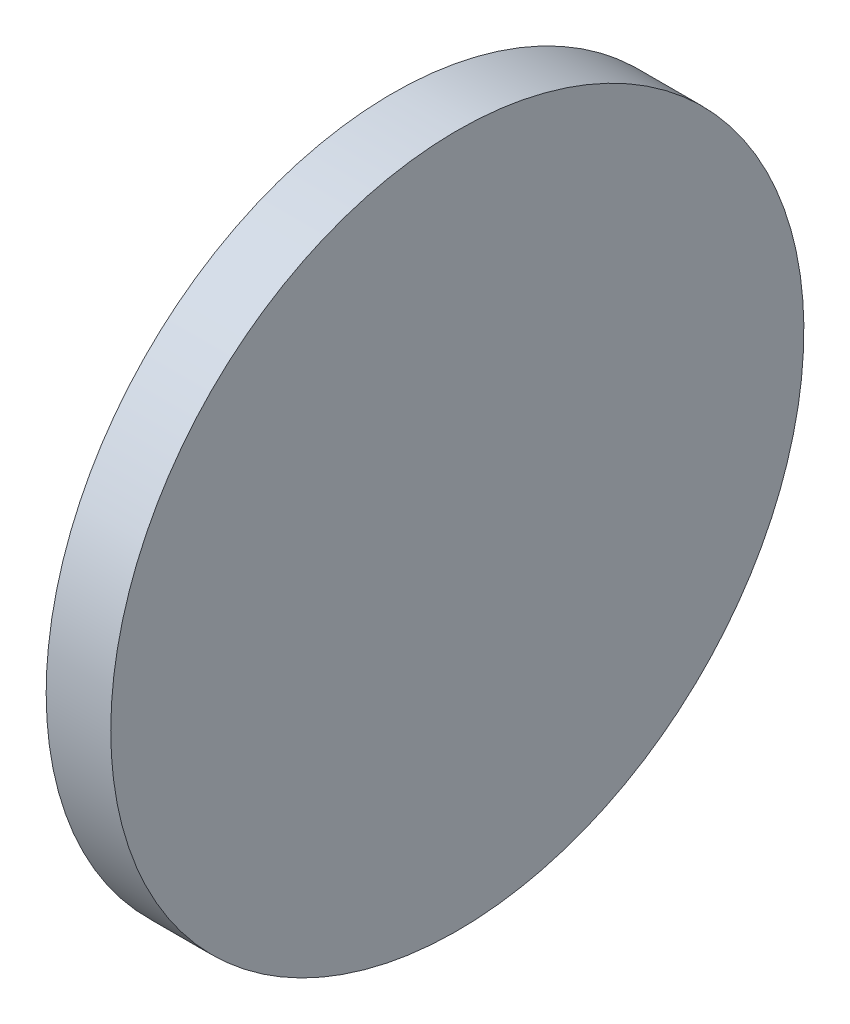
ISO-10303-21;
HEADER;
FILE_DESCRIPTION(('STEP AP214'),'2;1');
FILE_NAME('part.step','',(''),(''),'','','');
FILE_SCHEMA(('AUTOMOTIVE_DESIGN { 1 0 10303 214 1 1 1 1 }'));
ENDSEC;
DATA;
#1=APPLICATION_CONTEXT('core data for automotive mechanical design processes');
#2=APPLICATION_PROTOCOL_DEFINITION('international standard','automotive_design',2000,#1);
#3=PRODUCT_CONTEXT('',#1,'mechanical');
#4=PRODUCT('Part','Part','',(#3));
#5=PRODUCT_RELATED_PRODUCT_CATEGORY('part','',(#4));
#6=PRODUCT_DEFINITION_FORMATION('','',#4);
#7=PRODUCT_DEFINITION_CONTEXT('part definition',#1,'design');
#8=PRODUCT_DEFINITION('design','',#6,#7);
#9=PRODUCT_DEFINITION_SHAPE('','',#8);
#10=(LENGTH_UNIT() NAMED_UNIT(*) SI_UNIT(.MILLI.,.METRE.));
#11=(NAMED_UNIT(*) PLANE_ANGLE_UNIT() SI_UNIT($,.RADIAN.));
#12=(NAMED_UNIT(*) SI_UNIT($,.STERADIAN.) SOLID_ANGLE_UNIT());
#13=UNCERTAINTY_MEASURE_WITH_UNIT(LENGTH_MEASURE(1.E-05),#10,'distance_accuracy_value','');
#14=(GEOMETRIC_REPRESENTATION_CONTEXT(3) GLOBAL_UNCERTAINTY_ASSIGNED_CONTEXT((#13)) GLOBAL_UNIT_ASSIGNED_CONTEXT((#10,
#11,#12)) REPRESENTATION_CONTEXT('',''));
#15=CARTESIAN_POINT('',(0.,0.,0.));
#16=DIRECTION('',(0.,0.,1.));
#17=DIRECTION('',(1.,0.,0.));
#18=AXIS2_PLACEMENT_3D('',#15,#16,#17);
#19=CARTESIAN_POINT('',(-72.6014579242858,-1.44315441883233,-24.8428814120768));
#20=CARTESIAN_POINT('',(-72.6014579242858,-1.77786024486609,-24.8428814120768));
#21=CARTESIAN_POINT('',(-72.6014579242859,-2.44727189693362,-24.9088127051125));
#22=CARTESIAN_POINT('',(-72.6014579242859,-3.41280170346705,-25.2017029698485));
#23=CARTESIAN_POINT('',(-72.6014579242859,-4.30263906944289,-25.6773309511477));
#24=CARTESIAN_POINT('',(-72.6014579242858,-5.08258804391324,-26.317418532424));
#25=CARTESIAN_POINT('',(-72.6014579242859,-5.72267562518961,-27.0973675068944));
#26=CARTESIAN_POINT('',(-72.6014579242859,-6.19830360648881,-27.9872048728702));
#27=CARTESIAN_POINT('',(-72.6014579242859,-6.49119387122477,-28.9527346794037));
#28=CARTESIAN_POINT('',(-72.6014579242858,-6.59009081077842,-29.956852157505));
#29=CARTESIAN_POINT('',(-72.6014579242859,-6.49119387122477,-30.9609696356063));
#30=CARTESIAN_POINT('',(-72.6014579242859,-6.19830360648881,-31.9264994421397));
#31=CARTESIAN_POINT('',(-72.6014579242859,-5.72267562518961,-32.8163368081155));
#32=CARTESIAN_POINT('',(-72.6014579242859,-5.08258804391323,-33.5962857825859));
#33=CARTESIAN_POINT('',(-72.6014579242858,-4.30263906944289,-34.2363733638623));
#34=CARTESIAN_POINT('',(-72.6014579242859,-3.41280170346705,-34.7120013451615));
#35=CARTESIAN_POINT('',(-72.6014579242858,-2.44727189693362,-35.0048916098974));
#36=CARTESIAN_POINT('',(-72.6014579242859,-1.44315441883233,-35.1037885494511));
#37=CARTESIAN_POINT('',(-72.6014579242859,-0.439036940731032,-35.0048916098974));
#38=CARTESIAN_POINT('',(-72.6014579242858,0.526492865802393,-34.7120013451614));
#39=CARTESIAN_POINT('',(-72.6014579242859,1.41633023177824,-34.2363733638622));
#40=CARTESIAN_POINT('',(-72.6014579242859,2.19627920624858,-33.5962857825859));
#41=CARTESIAN_POINT('',(-72.6014579242859,2.83636678752495,-32.8163368081155));
#42=CARTESIAN_POINT('',(-72.6014579242858,3.31199476882416,-31.9264994421397));
#43=CARTESIAN_POINT('',(-72.6014579242859,3.60488503356012,-30.9609696356063));
#44=CARTESIAN_POINT('',(-72.6014579242859,3.70378197311377,-29.956852157505));
#45=CARTESIAN_POINT('',(-72.6014579242859,3.60488503356012,-28.9527346794037));
#46=CARTESIAN_POINT('',(-72.6014579242859,3.31199476882416,-27.9872048728702));
#47=CARTESIAN_POINT('',(-72.6014579242859,2.83636678752495,-27.0973675068944));
#48=CARTESIAN_POINT('',(-72.6014579242859,2.19627920624858,-26.3174185324241));
#49=CARTESIAN_POINT('',(-72.6014579242859,1.41633023177824,-25.6773309511477));
#50=CARTESIAN_POINT('',(-72.6014579242859,0.526492865802399,-25.2017029698485));
#51=CARTESIAN_POINT('',(-72.6014579242859,-0.439036940731031,-24.9088127051125));
#52=CARTESIAN_POINT('',(-72.6014579242858,-1.10844859279856,-24.8428814120768));
#53=CARTESIAN_POINT('',(-72.6014579242858,-1.44315441883233,-24.8428814120768));
#54=B_SPLINE_CURVE_WITH_KNOTS('',3,(#19,#20,#21,#22,#23,#24,#25,#26,#27,#28,#29,#30,#31,#32,#33,
#34,#35,#36,#37,#38,#39,#40,#41,#42,#43,#44,#45,#46,#47,#48,#49,#50,#51,#52,#53),.UNSPECIFIED.,
.T.,.F.,(4,1,1,1,1,1,1,1,1,1,1,1,1,1,1,1,1,1,1,1,1,1,1,1,1,1,1,1,1,1,1,1,4),(0.,0.03125,0.0625,
0.09375,0.125,0.15625,0.1875,0.21875,0.25,0.28125,0.3125,0.34375,0.375,0.40625,0.4375,0.46875,
0.5,0.53125,0.5625,0.59375,0.625,0.65625,0.6875,0.71875,0.75,0.78125,0.8125,0.84375,0.875,
0.90625,0.9375,0.96875,1.),.UNSPECIFIED.);
#55=DIRECTION('',(-1.,0.,0.));
#56=VECTOR('',#55,1.);
#57=SURFACE_OF_LINEAR_EXTRUSION('',#54,#56);
#58=CARTESIAN_POINT('',(-72.6014579242859,-1.44315441883233,-24.8428814120768));
#59=CARTESIAN_POINT('',(-72.6014579242859,-1.35947744852017,-24.8428814294332));
#60=CARTESIAN_POINT('',(-72.6014579242859,-1.27580108719835,-24.8449417895898));
#61=CARTESIAN_POINT('',(-72.6014579242859,-1.10864933966623,-24.8531633893883));
#62=CARTESIAN_POINT('',(-72.6014579242859,-1.02517395502213,-24.8593246608851));
#63=CARTESIAN_POINT('',(-72.6014579242859,-0.858625224189889,-24.8757282766317));
#64=CARTESIAN_POINT('',(-72.6014579242859,-0.775551878001752,-24.8859706208816));
#65=CARTESIAN_POINT('',(-72.6014579242859,-0.610007776786704,-24.9105167120388));
#66=CARTESIAN_POINT('',(-72.6014579242859,-0.527537017083982,-24.9248204273972));
#67=CARTESIAN_POINT('',(-72.6014579242859,-0.36339942156737,-24.9574694245553));
#68=CARTESIAN_POINT('',(-72.6014579242859,-0.28173258575348,-24.975814706355));
#69=CARTESIAN_POINT('',(-72.6014579242859,-0.119396384715076,-25.0164880645046));
#70=CARTESIAN_POINT('',(-72.6014579242859,-0.0387270272437294,-25.0388161717913));
#71=CARTESIAN_POINT('',(-72.6014579242859,0.121421280976538,-25.0873966299091));
#72=CARTESIAN_POINT('',(-72.6014579242859,0.200900231725458,-25.1136489807403));
#73=CARTESIAN_POINT('',(-72.6014579242859,0.35847475769488,-25.1700194809434));
#74=CARTESIAN_POINT('',(-72.6014579242859,0.436570343656408,-25.2001376002848));
#75=CARTESIAN_POINT('',(-72.6014579242859,0.591184574429195,-25.2641809115999));
#76=CARTESIAN_POINT('',(-72.6014579242859,0.667703219240453,-25.2981061035737));
#77=CARTESIAN_POINT('',(-72.6014579242859,0.818985198094877,-25.3696681565231));
#78=CARTESIAN_POINT('',(-72.6014579242859,0.893748518498367,-25.4073050463285));
#79=CARTESIAN_POINT('',(-72.6014579242859,1.04134204441298,-25.4861954295235));
#80=CARTESIAN_POINT('',(-72.6014579242859,1.1141722499241,-25.527448922913));
#81=CARTESIAN_POINT('',(-72.6014579242859,1.25772168659196,-25.613477544791));
#82=CARTESIAN_POINT('',(-72.6014579242859,1.328440934142,-25.6582526459215));
#83=CARTESIAN_POINT('',(-72.6014579242859,1.46759006557931,-25.7512291230329));
#84=CARTESIAN_POINT('',(-72.6014579242859,1.53601994946659,-25.7994304990137));
#85=CARTESIAN_POINT('',(-72.6014579242859,1.67043402356808,-25.8991311571531));
#86=CARTESIAN_POINT('',(-72.6014579242859,1.7364181947803,-25.9506304649265));
#87=CARTESIAN_POINT('',(-72.6014579242859,1.86578500221738,-26.0567990600274));
#88=CARTESIAN_POINT('',(-72.6014579242859,1.92916763844226,-26.1114683473548));
#89=CARTESIAN_POINT('',(-72.6014579242859,2.05317546139184,-26.2238490592109));
#90=CARTESIAN_POINT('',(-72.6014579242859,2.11380066953212,-26.2815604601056));
#91=CARTESIAN_POINT('',(-72.6014579242859,2.23213727856706,-26.3998970691405));
#92=CARTESIAN_POINT('',(-72.6014579242859,2.28984867946172,-26.4605222772808));
#93=CARTESIAN_POINT('',(-72.6014579242859,2.40222939131788,-26.5845301002304));
#94=CARTESIAN_POINT('',(-72.6014579242859,2.45689867864529,-26.6479127364553));
#95=CARTESIAN_POINT('',(-72.6014579242859,2.56306727374612,-26.7772795438923));
#96=CARTESIAN_POINT('',(-72.6014579242859,2.61456658151954,-26.8432637151046));
#97=CARTESIAN_POINT('',(-72.6014579242859,2.71426723965892,-26.9776777892061));
#98=CARTESIAN_POINT('',(-72.6014579242859,2.76246861563974,-27.0461076730934));
#99=CARTESIAN_POINT('',(-72.6014579242859,2.85544509275112,-27.1852568045306));
#100=CARTESIAN_POINT('',(-72.6014579242859,2.90022019388167,-27.2559760520805));
#101=CARTESIAN_POINT('',(-72.6014579242859,2.98624881575968,-27.3995254887487));
#102=CARTESIAN_POINT('',(-72.6014579242859,3.02750230914919,-27.4723556942603));
#103=CARTESIAN_POINT('',(-72.6014579242859,3.10639269234408,-27.6199492201736));
#104=CARTESIAN_POINT('',(-72.6014579242859,3.14402958214944,-27.6947125405753));
#105=CARTESIAN_POINT('',(-72.6014579242859,3.2155916350991,-27.8459945194347));
#106=CARTESIAN_POINT('',(-72.6014579242859,3.24951682707317,-27.9225131642528));
#107=CARTESIAN_POINT('',(-72.6014579242859,3.3135601383874,-28.0771273950069));
#108=CARTESIAN_POINT('',(-72.6014579242859,3.34367825772756,-28.1552229809429));
#109=CARTESIAN_POINT('',(-72.6014579242859,3.40004875793405,-28.3127975069821));
#110=CARTESIAN_POINT('',(-72.6014579242859,3.42630110876994,-28.3922764578262));
#111=CARTESIAN_POINT('',(-72.6014579242859,3.47488156687494,-28.5524247657863));
#112=CARTESIAN_POINT('',(-72.6014579242859,3.49720967414405,-28.6330941229021));
#113=CARTESIAN_POINT('',(-72.6014579242859,3.53788303234158,-28.7954303249118));
#114=CARTESIAN_POINT('',(-72.6014579242859,3.55622831420681,-28.8770971620524));
#115=CARTESIAN_POINT('',(-72.6014579242859,3.58887731118599,-29.0412347539442));
#116=CARTESIAN_POINT('',(-72.6014579242859,3.60318102629996,-29.1237055086953));
#117=CARTESIAN_POINT('',(-72.6014579242859,3.62772711812493,-29.2892496234385));
#118=CARTESIAN_POINT('',(-72.6014579242859,3.63796946328706,-29.3723229881066));
#119=CARTESIAN_POINT('',(-72.6014579242859,3.65437307654143,-29.5388716684507));
#120=CARTESIAN_POINT('',(-72.6014579242859,3.66053434463367,-29.6223469841266));
#121=CARTESIAN_POINT('',(-72.6014579242859,3.66875595373344,-29.7894989200825));
#122=CARTESIAN_POINT('',(-72.6014579242859,3.67081632659588,-29.8731755387937));
#123=CARTESIAN_POINT('',(-72.6014579242859,3.67081632659588,-30.0405287762162));
#124=CARTESIAN_POINT('',(-72.6014579242859,3.66875595373344,-30.1242053949274));
#125=CARTESIAN_POINT('',(-72.6014579242859,3.66053434463367,-30.2913573308833));
#126=CARTESIAN_POINT('',(-72.6014579242859,3.65437307654143,-30.3748326465593));
#127=CARTESIAN_POINT('',(-72.6014579242859,3.63796946328706,-30.5413813269033));
#128=CARTESIAN_POINT('',(-72.6014579242859,3.62772711812493,-30.6244546915714));
#129=CARTESIAN_POINT('',(-72.6014579242859,3.60318102629996,-30.7899988063146));
#130=CARTESIAN_POINT('',(-72.6014579242859,3.58887731118599,-30.8724695610657));
#131=CARTESIAN_POINT('',(-72.6014579242859,3.5562283142068,-31.0366071529575));
#132=CARTESIAN_POINT('',(-72.6014579242859,3.53788303234158,-31.1182739900982));
#133=CARTESIAN_POINT('',(-72.6014579242859,3.49720967414404,-31.2806101921079));
#134=CARTESIAN_POINT('',(-72.6014579242859,3.47488156687494,-31.3612795492237));
#135=CARTESIAN_POINT('',(-72.6014579242859,3.42630110876994,-31.5214278571837));
#136=CARTESIAN_POINT('',(-72.6014579242859,3.40004875793405,-31.6009068080279));
#137=CARTESIAN_POINT('',(-72.6014579242859,3.34367825772756,-31.758481334067));
#138=CARTESIAN_POINT('',(-72.6014579242859,3.3135601383874,-31.836576920003));
#139=CARTESIAN_POINT('',(-72.6014579242859,3.24951682707317,-31.9911911507571));
#140=CARTESIAN_POINT('',(-72.6014579242859,3.21559163509909,-32.0677097955752));
#141=CARTESIAN_POINT('',(-72.6014579242859,3.14402958214944,-32.2189917744347));
#142=CARTESIAN_POINT('',(-72.6014579242859,3.10639269234407,-32.2937550948363));
#143=CARTESIAN_POINT('',(-72.6014579242859,3.02750230914919,-32.4413486207496));
#144=CARTESIAN_POINT('',(-72.6014579242859,2.98624881575967,-32.5141788262612));
#145=CARTESIAN_POINT('',(-72.6014579242859,2.90022019388166,-32.6577282629294));
#146=CARTESIAN_POINT('',(-72.6014579242859,2.85544509275111,-32.7284475104793));
#147=CARTESIAN_POINT('',(-72.6014579242859,2.76246861563974,-32.8675966419166));
#148=CARTESIAN_POINT('',(-72.6014579242859,2.71426723965891,-32.9360265258039));
#149=CARTESIAN_POINT('',(-72.6014579242859,2.61456658151953,-33.0704405999054));
#150=CARTESIAN_POINT('',(-72.6014579242859,2.56306727374611,-33.1364247711176));
#151=CARTESIAN_POINT('',(-72.6014579242859,2.45689867864528,-33.2657915785547));
#152=CARTESIAN_POINT('',(-72.6014579242859,2.40222939131787,-33.3291742147795));
#153=CARTESIAN_POINT('',(-72.6014579242859,2.28984867946171,-33.4531820377291));
#154=CARTESIAN_POINT('',(-72.6014579242859,2.23213727856705,-33.5138072458694));
#155=CARTESIAN_POINT('',(-72.6014579242859,2.11380066953211,-33.6321438549043));
#156=CARTESIAN_POINT('',(-72.6014579242859,2.05317546139184,-33.689855255799));
#157=CARTESIAN_POINT('',(-72.6014579242859,1.92916763844225,-33.8022359676552));
#158=CARTESIAN_POINT('',(-72.6014579242859,1.86578500221737,-33.8569052549826));
#159=CARTESIAN_POINT('',(-72.6014579242859,1.73641819478029,-33.9630738500834));
#160=CARTESIAN_POINT('',(-72.6014579242859,1.67043402356809,-34.0145731578568));
#161=CARTESIAN_POINT('',(-72.6014579242859,1.53601994946657,-34.1142738159962));
#162=CARTESIAN_POINT('',(-72.6014579242859,1.46759006557926,-34.162475191977));
#163=CARTESIAN_POINT('',(-72.6014579242859,1.32844093414204,-34.2554516690884));
#164=CARTESIAN_POINT('',(-72.6014579242859,1.25772168659213,-34.300226770219));
#165=CARTESIAN_POINT('',(-72.6014579242859,1.11417224992391,-34.386255392097));
#166=CARTESIAN_POINT('',(-72.6014579242859,1.0413420444123,-34.4275088854865));
#167=CARTESIAN_POINT('',(-72.6014579242859,0.893748518499027,-34.5063992686814));
#168=CARTESIAN_POINT('',(-72.6014579242859,0.818985198097371,-34.5440361584867));
#169=CARTESIAN_POINT('',(-72.6014579242859,0.667703219237941,-34.6155982114364));
#170=CARTESIAN_POINT('',(-72.6014579242859,0.591184574419841,-34.6495234034105));
#171=CARTESIAN_POINT('',(-72.6014579242859,0.43657034366574,-34.7135667147247));
#172=CARTESIAN_POINT('',(-72.6014579242859,0.358474757729737,-34.7436848340649));
#173=CARTESIAN_POINT('',(-72.6014579242859,0.200900231690581,-34.8000553342713));
#174=CARTESIAN_POINT('',(-72.6014579242859,0.121421280846399,-34.8263076851072));
#175=CARTESIAN_POINT('',(-72.6014579242859,-0.0387270271136126,-34.8748881432122));
#176=CARTESIAN_POINT('',(-72.6014579242859,-0.119396384229442,-34.8972162504813));
#177=CARTESIAN_POINT('',(-72.6014579242859,-0.281732586239127,-34.9378896086789));
#178=CARTESIAN_POINT('',(-72.6014579242859,-0.363399423379803,-34.9562348905441));
#179=CARTESIAN_POINT('',(-72.6014579242859,-0.527537015271567,-34.9888838875233));
#180=CARTESIAN_POINT('',(-72.6014579242859,-0.610007770022656,-35.0031876026373));
#181=CARTESIAN_POINT('',(-72.6014579242859,-0.77555188476587,-35.0277336944622));
#182=CARTESIAN_POINT('',(-72.6014579242859,-0.858625249433989,-35.0379760396244));
#183=CARTESIAN_POINT('',(-72.6014579242859,-1.02517392977805,-35.0543796528787));
#184=CARTESIAN_POINT('',(-72.6014579242859,-1.10864924545399,-35.060540920971));
#185=CARTESIAN_POINT('',(-72.6014579242859,-1.27580118140989,-35.0687625300707));
#186=CARTESIAN_POINT('',(-72.6014579242859,-1.35947780012111,-35.0708229029332));
#187=CARTESIAN_POINT('',(-72.6014579242859,-1.52683103754356,-35.0708229029332));
#188=CARTESIAN_POINT('',(-72.6014579242859,-1.61050765625478,-35.0687625300707));
#189=CARTESIAN_POINT('',(-72.6014579242859,-1.77765959221068,-35.060540920971));
#190=CARTESIAN_POINT('',(-72.6014579242859,-1.86113490788662,-35.0543796528787));
#191=CARTESIAN_POINT('',(-72.6014579242859,-2.02768358823068,-35.0379760396243));
#192=CARTESIAN_POINT('',(-72.6014579242859,-2.1107569528988,-35.0277336944622));
#193=CARTESIAN_POINT('',(-72.6014579242859,-2.27630106764201,-35.0031876026372));
#194=CARTESIAN_POINT('',(-72.6014579242859,-2.3587718223931,-34.9888838875233));
#195=CARTESIAN_POINT('',(-72.6014579242859,-2.52290941428486,-34.9562348905441));
#196=CARTESIAN_POINT('',(-72.6014579242859,-2.60457625142554,-34.9378896086789));
#197=CARTESIAN_POINT('',(-72.6014579242859,-2.76691245343522,-34.8972162504813));
#198=CARTESIAN_POINT('',(-72.6014579242859,-2.84758181055105,-34.8748881432122));
#199=CARTESIAN_POINT('',(-72.6014579242859,-3.00773011851107,-34.8263076851072));
#200=CARTESIAN_POINT('',(-72.6014579242859,-3.08720906935525,-34.8000553342713));
#201=CARTESIAN_POINT('',(-72.6014579242859,-3.2447835953944,-34.7436848340649));
#202=CARTESIAN_POINT('',(-72.6014579242859,-3.32287918133041,-34.7135667147247));
#203=CARTESIAN_POINT('',(-72.6014579242859,-3.47749341208451,-34.6495234034105));
#204=CARTESIAN_POINT('',(-72.6014579242859,-3.5540120569026,-34.6155982114364));
#205=CARTESIAN_POINT('',(-72.6014579242859,-3.70529403576204,-34.5440361584867));
#206=CARTESIAN_POINT('',(-72.6014579242859,-3.7800573561637,-34.5063992686814));
#207=CARTESIAN_POINT('',(-72.6014579242859,-3.92765088207696,-34.4275088854865));
#208=CARTESIAN_POINT('',(-72.6014579242859,-4.00048108758857,-34.386255392097));
#209=CARTESIAN_POINT('',(-72.6014579242859,-4.1440305242568,-34.300226770219));
#210=CARTESIAN_POINT('',(-72.6014579242859,-4.21474977180671,-34.2554516690884));
#211=CARTESIAN_POINT('',(-72.6014579242859,-4.35389890324392,-34.162475191977));
#212=CARTESIAN_POINT('',(-72.6014579242859,-4.42232878713124,-34.1142738159962));
#213=CARTESIAN_POINT('',(-72.6014579242859,-4.55674286123275,-34.0145731578568));
#214=CARTESIAN_POINT('',(-72.6014579242859,-4.62272703244496,-33.9630738500834));
#215=CARTESIAN_POINT('',(-72.6014579242859,-4.75209383988203,-33.8569052549826));
#216=CARTESIAN_POINT('',(-72.6014579242859,-4.81547647610691,-33.8022359676552));
#217=CARTESIAN_POINT('',(-72.6014579242859,-4.9394842990565,-33.689855255799));
#218=CARTESIAN_POINT('',(-72.6014579242859,-5.00010950719678,-33.6321438549043));
#219=CARTESIAN_POINT('',(-72.6014579242859,-5.11844611623171,-33.5138072458694));
#220=CARTESIAN_POINT('',(-72.6014579242859,-5.17615751712637,-33.4531820377291));
#221=CARTESIAN_POINT('',(-72.6014579242859,-5.28853822898253,-33.3291742147795));
#222=CARTESIAN_POINT('',(-72.6014579242859,-5.34320751630994,-33.2657915785547));
#223=CARTESIAN_POINT('',(-72.6014579242859,-5.44937611141077,-33.1364247711176));
#224=CARTESIAN_POINT('',(-72.6014579242859,-5.50087541918419,-33.0704405999054));
#225=CARTESIAN_POINT('',(-72.6014579242859,-5.60057607732357,-32.9360265258039));
#226=CARTESIAN_POINT('',(-72.6014579242859,-5.6487774533044,-32.8675966419166));
#227=CARTESIAN_POINT('',(-72.6014579242859,-5.74175393041577,-32.7284475104793));
#228=CARTESIAN_POINT('',(-72.6014579242859,-5.78652903154632,-32.6577282629294));
#229=CARTESIAN_POINT('',(-72.6014579242859,-5.87255765342433,-32.5141788262612));
#230=CARTESIAN_POINT('',(-72.6014579242859,-5.91381114681385,-32.4413486207496));
#231=CARTESIAN_POINT('',(-72.6014579242859,-5.99270153000873,-32.2937550948363));
#232=CARTESIAN_POINT('',(-72.6014579242859,-6.0303384198141,-32.2189917744347));
#233=CARTESIAN_POINT('',(-72.6014579242859,-6.10190047276375,-32.0677097955752));
#234=CARTESIAN_POINT('',(-72.6014579242859,-6.13582566473782,-31.9911911507571));
#235=CARTESIAN_POINT('',(-72.6014579242859,-6.19986897605206,-31.836576920003));
#236=CARTESIAN_POINT('',(-72.6014579242859,-6.22998709539222,-31.758481334067));
#237=CARTESIAN_POINT('',(-72.6014579242859,-6.28635759559871,-31.6009068080279));
#238=CARTESIAN_POINT('',(-72.6014579242859,-6.31260994643459,-31.5214278571837));
#239=CARTESIAN_POINT('',(-72.6014579242859,-6.36119040453959,-31.3612795492237));
#240=CARTESIAN_POINT('',(-72.6014579242859,-6.3835185118087,-31.2806101921079));
#241=CARTESIAN_POINT('',(-72.6014579242859,-6.42419187000624,-31.1182739900982));
#242=CARTESIAN_POINT('',(-72.6014579242859,-6.44253715187146,-31.0366071529575));
#243=CARTESIAN_POINT('',(-72.6014579242859,-6.47518614885065,-30.8724695610657));
#244=CARTESIAN_POINT('',(-72.6014579242859,-6.48948986396461,-30.7899988063146));
#245=CARTESIAN_POINT('',(-72.6014579242859,-6.51403595578959,-30.6244546915714));
#246=CARTESIAN_POINT('',(-72.6014579242859,-6.52427830095171,-30.5413813269033));
#247=CARTESIAN_POINT('',(-72.6014579242859,-6.54068191420608,-30.3748326465593));
#248=CARTESIAN_POINT('',(-72.6014579242859,-6.54684318229832,-30.2913573308833));
#249=CARTESIAN_POINT('',(-72.6014579242859,-6.55506479139809,-30.1242053949274));
#250=CARTESIAN_POINT('',(-72.6014579242859,-6.55712516426054,-30.0405287762162));
#251=CARTESIAN_POINT('',(-72.6014579242859,-6.55712516426054,-29.8731755387937));
#252=CARTESIAN_POINT('',(-72.6014579242859,-6.55506479139809,-29.7894989200825));
#253=CARTESIAN_POINT('',(-72.6014579242859,-6.54684318229832,-29.6223469841266));
#254=CARTESIAN_POINT('',(-72.6014579242859,-6.54068191420608,-29.5388716684507));
#255=CARTESIAN_POINT('',(-72.6014579242859,-6.52427830095171,-29.3723229881066));
#256=CARTESIAN_POINT('',(-72.6014579242859,-6.51403595578958,-29.2892496234385));
#257=CARTESIAN_POINT('',(-72.6014579242859,-6.48948986396461,-29.1237055086953));
#258=CARTESIAN_POINT('',(-72.6014579242859,-6.47518614885065,-29.0412347539442));
#259=CARTESIAN_POINT('',(-72.6014579242859,-6.44253715187146,-28.8770971620524));
#260=CARTESIAN_POINT('',(-72.6014579242859,-6.42419187000624,-28.7954303249118));
#261=CARTESIAN_POINT('',(-72.6014579242859,-6.3835185118087,-28.6330941229021));
#262=CARTESIAN_POINT('',(-72.6014579242859,-6.36119040453959,-28.5524247657862));
#263=CARTESIAN_POINT('',(-72.6014579242859,-6.31260994643459,-28.3922764578262));
#264=CARTESIAN_POINT('',(-72.6014579242859,-6.28635759559871,-28.3127975069821));
#265=CARTESIAN_POINT('',(-72.6014579242859,-6.22998709539222,-28.1552229809429));
#266=CARTESIAN_POINT('',(-72.6014579242859,-6.19986897605205,-28.0771273950069));
#267=CARTESIAN_POINT('',(-72.6014579242859,-6.13582566473782,-27.9225131642528));
#268=CARTESIAN_POINT('',(-72.6014579242859,-6.10190047276375,-27.8459945194347));
#269=CARTESIAN_POINT('',(-72.6014579242859,-6.03033841981409,-27.6947125405753));
#270=CARTESIAN_POINT('',(-72.6014579242859,-5.99270153000873,-27.6199492201736));
#271=CARTESIAN_POINT('',(-72.6014579242859,-5.91381114681384,-27.4723556942603));
#272=CARTESIAN_POINT('',(-72.6014579242859,-5.87255765342433,-27.3995254887487));
#273=CARTESIAN_POINT('',(-72.6014579242859,-5.78652903154632,-27.2559760520805));
#274=CARTESIAN_POINT('',(-72.6014579242859,-5.74175393041577,-27.1852568045306));
#275=CARTESIAN_POINT('',(-72.6014579242859,-5.64877745330439,-27.0461076730934));
#276=CARTESIAN_POINT('',(-72.6014579242859,-5.60057607732357,-26.9776777892061));
#277=CARTESIAN_POINT('',(-72.6014579242859,-5.50087541918419,-26.8432637151046));
#278=CARTESIAN_POINT('',(-72.6014579242859,-5.44937611141077,-26.7772795438923));
#279=CARTESIAN_POINT('',(-72.6014579242859,-5.34320751630994,-26.6479127364553));
#280=CARTESIAN_POINT('',(-72.6014579242859,-5.28853822898253,-26.5845301002304));
#281=CARTESIAN_POINT('',(-72.6014579242859,-5.17615751712637,-26.4605222772808));
#282=CARTESIAN_POINT('',(-72.6014579242859,-5.11844611623171,-26.3998970691405));
#283=CARTESIAN_POINT('',(-72.6014579242859,-5.00010950719677,-26.2815604601056));
#284=CARTESIAN_POINT('',(-72.6014579242859,-4.9394842990565,-26.2238490592109));
#285=CARTESIAN_POINT('',(-72.6014579242859,-4.81547647610691,-26.1114683473548));
#286=CARTESIAN_POINT('',(-72.6014579242859,-4.75209383988203,-26.0567990600274));
#287=CARTESIAN_POINT('',(-72.6014579242859,-4.62272703244495,-25.9506304649265));
#288=CARTESIAN_POINT('',(-72.6014579242859,-4.55674286123273,-25.8991311571531));
#289=CARTESIAN_POINT('',(-72.6014579242859,-4.42232878713124,-25.7994304990137));
#290=CARTESIAN_POINT('',(-72.6014579242859,-4.35389890324396,-25.7512291230329));
#291=CARTESIAN_POINT('',(-72.6014579242859,-4.21474977180665,-25.6582526459215));
#292=CARTESIAN_POINT('',(-72.6014579242859,-4.14403052425661,-25.613477544791));
#293=CARTESIAN_POINT('',(-72.6014579242859,-4.00048108758875,-25.527448922913));
#294=CARTESIAN_POINT('',(-72.6014579242859,-3.92765088207763,-25.4861954295235));
#295=CARTESIAN_POINT('',(-72.6014579242859,-3.78005735616302,-25.4073050463285));
#296=CARTESIAN_POINT('',(-72.6014579242859,-3.70529403575953,-25.3696681565231));
#297=CARTESIAN_POINT('',(-72.6014579242859,-3.5540120569051,-25.2981061035737));
#298=CARTESIAN_POINT('',(-72.6014579242859,-3.47749341209385,-25.2641809115999));
#299=CARTESIAN_POINT('',(-72.6014579242859,-3.32287918132106,-25.2001376002848));
#300=CARTESIAN_POINT('',(-72.6014579242859,-3.24478359535953,-25.1700194809434));
#301=CARTESIAN_POINT('',(-72.6014579242859,-3.08720906939011,-25.1136489807403));
#302=CARTESIAN_POINT('',(-72.6014579242859,-3.00773011864119,-25.0873966299091));
#303=CARTESIAN_POINT('',(-72.6014579242859,-2.84758181042092,-25.0388161717913));
#304=CARTESIAN_POINT('',(-72.6014579242859,-2.76691245294957,-25.0164880645046));
#305=CARTESIAN_POINT('',(-72.6014579242859,-2.60457625191117,-24.975814706355));
#306=CARTESIAN_POINT('',(-72.6014579242859,-2.52290941609728,-24.9574694245553));
#307=CARTESIAN_POINT('',(-72.6014579242859,-2.35877182058067,-24.9248204273972));
#308=CARTESIAN_POINT('',(-72.6014579242859,-2.27630106087795,-24.9105167120388));
#309=CARTESIAN_POINT('',(-72.6014579242859,-2.1107569596629,-24.8859706208816));
#310=CARTESIAN_POINT('',(-72.6014579242859,-2.02768361347476,-24.8757282766317));
#311=CARTESIAN_POINT('',(-72.6014579242859,-1.86113488264252,-24.8593246608851));
#312=CARTESIAN_POINT('',(-72.6014579242859,-1.77765949799842,-24.8531633893883));
#313=CARTESIAN_POINT('',(-72.6014579242859,-1.6105077504663,-24.8449417895898));
#314=CARTESIAN_POINT('',(-72.6014579242859,-1.52683138914448,-24.8428814294332));
#315=CARTESIAN_POINT('',(-72.6014579242859,-1.44315441883233,-24.8428814120768));
#316=B_SPLINE_CURVE_WITH_KNOTS('',3,(#58,#59,#60,#61,#62,#63,#64,#65,#66,#67,#68,#69,#70,#71,
#72,#73,#74,#75,#76,#77,#78,#79,#80,#81,#82,#83,#84,#85,#86,#87,#88,#89,#90,#91,#92,#93,#94,#95,
#96,#97,#98,#99,#100,#101,#102,#103,#104,#105,#106,#107,#108,#109,#110,#111,#112,#113,#114,#115,
#116,#117,#118,#119,#120,#121,#122,#123,#124,#125,#126,#127,#128,#129,#130,#131,#132,#133,#134,
#135,#136,#137,#138,#139,#140,#141,#142,#143,#144,#145,#146,#147,#148,#149,#150,#151,#152,#153,
#154,#155,#156,#157,#158,#159,#160,#161,#162,#163,#164,#165,#166,#167,#168,#169,#170,#171,#172,
#173,#174,#175,#176,#177,#178,#179,#180,#181,#182,#183,#184,#185,#186,#187,#188,#189,#190,#191,
#192,#193,#194,#195,#196,#197,#198,#199,#200,#201,#202,#203,#204,#205,#206,#207,#208,#209,#210,
#211,#212,#213,#214,#215,#216,#217,#218,#219,#220,#221,#222,#223,#224,#225,#226,#227,#228,#229,
#230,#231,#232,#233,#234,#235,#236,#237,#238,#239,#240,#241,#242,#243,#244,#245,#246,#247,#248,
#249,#250,#251,#252,#253,#254,#255,#256,#257,#258,#259,#260,#261,#262,#263,#264,#265,#266,#267,
#268,#269,#270,#271,#272,#273,#274,#275,#276,#277,#278,#279,#280,#281,#282,#283,#284,#285,#286,
#287,#288,#289,#290,#291,#292,#293,#294,#295,#296,#297,#298,#299,#300,#301,#302,#303,#304,#305,
#306,#307,#308,#309,#310,#311,#312,#313,#314,#315),.UNSPECIFIED.,.F.,.F.,(4,2,2,2,2,2,2,2,2,2,2,
2,2,2,2,2,2,2,2,2,2,2,2,2,2,2,2,2,2,2,2,2,2,2,2,2,2,2,2,2,2,2,2,2,2,2,2,2,2,2,2,2,2,2,2,2,2,2,2,
2,2,2,2,2,2,2,2,2,2,2,2,2,2,2,2,2,2,2,2,2,2,2,2,2,2,2,2,2,2,2,2,2,2,2,2,2,2,2,2,2,2,2,2,2,2,2,2,
2,2,2,2,2,2,2,2,2,2,2,2,2,2,2,2,2,2,2,2,2,4),(0.,0.251004753842975,0.502011457462747,
0.753018161082518,1.00402291492549,1.25502766876847,1.50603437238824,1.75704107600801,
2.00804582985098,2.25905058369396,2.51005728731373,2.7610639909335,3.01206874477647,
3.26307349861945,3.51408020223922,3.765086905859,4.01609165970197,4.26709641354494,
4.51810311716471,4.76910982078449,5.02011457462746,5.27111932847044,5.52212603209021,
5.77313273570998,6.02413748955295,6.27514224339593,6.5261489470157,6.77715565063547,
7.02816040447845,7.27916515832142,7.53017186194118,7.78117856556096,8.03218331940393,
8.2831880732469,8.53419477686668,8.78520148048645,9.03620623432942,9.2872109881724,
9.53821769179217,9.78922439541194,10.0402291492549,10.2912339030979,10.5422406067177,
10.7932473103374,11.0442520641804,11.2952568180234,11.5462635216432,11.7972702252629,
12.0482749791059,12.2992797329489,12.5502864365686,12.8012931401884,13.0522978940314,
13.3033026478744,13.5543093514941,13.8053160551139,14.0563208089569,14.3073255627999,
14.5583322664196,14.8093389700394,15.0603437238824,15.3113484777253,15.5623551813451,
15.8133618849649,16.0643666388079,16.3153713926508,16.5663780962706,16.8173847998904,
17.0683895537334,17.3193943075763,17.5704010111961,17.8214077148159,18.0724124686588,
18.3234172225018,18.5744239261216,18.8254306297414,19.0764353835843,19.3274401374273,
19.5784468410471,19.8294535446669,20.0804582985098,20.3314630523528,20.5824697559726,
20.8334764595923,21.0844812134353,21.3354859672783,21.5864926708981,21.8374993745178,
22.0885041283608,22.3395088822038,22.5905155858235,22.8415222894433,23.0925270432863,
23.3435317971293,23.594538500749,23.8455452043688,24.0965499582118,24.3475547120548,
24.5985614156745,24.8495681192943,25.1005728731373,25.3515776269802,25.6025843306,
25.8535910342198,26.1045957880628,26.3556005419058,26.6066072455255,26.8576139491453,
27.1086187029883,27.3596234568312,27.610630160451,27.8616368640708,28.1126416179138,
28.3636463717567,28.6146530753765,28.8656597789963,29.1166645328392,29.3676692866822,
29.618675990302,29.8696826939218,30.1206874477647,30.3716922016077,30.6226989052275,
30.8737056088473,31.1247103626902,31.3757151165332,31.626721820153,31.8777285237727,
32.1287332776157),.UNSPECIFIED.);
#317=CARTESIAN_POINT('',(-72.6014579242859,-1.44315441883233,-24.8428814120768));
#318=VERTEX_POINT('',#317);
#319=EDGE_CURVE('E9',#318,#318,#316,.F.);
#320=ORIENTED_EDGE('',*,*,#319,.F.);
#321=EDGE_LOOP('',(#320));
#322=FACE_BOUND('',#321,.T.);
#323=CARTESIAN_POINT('',(-73.5542140571372,-1.44315441883233,-24.8428814120768));
#324=CARTESIAN_POINT('',(-73.5542140571372,-1.77786024486609,-24.8428814120768));
#325=CARTESIAN_POINT('',(-73.5542140571372,-2.44727189693362,-24.9088127051125));
#326=CARTESIAN_POINT('',(-73.5542140571372,-3.41280170346705,-25.2017029698485));
#327=CARTESIAN_POINT('',(-73.5542140571372,-4.30263906944289,-25.6773309511477));
#328=CARTESIAN_POINT('',(-73.5542140571372,-5.08258804391324,-26.317418532424));
#329=CARTESIAN_POINT('',(-73.5542140571372,-5.72267562518961,-27.0973675068944));
#330=CARTESIAN_POINT('',(-73.5542140571372,-6.19830360648881,-27.9872048728702));
#331=CARTESIAN_POINT('',(-73.5542140571372,-6.49119387122477,-28.9527346794037));
#332=CARTESIAN_POINT('',(-73.5542140571372,-6.59009081077842,-29.956852157505));
#333=CARTESIAN_POINT('',(-73.5542140571372,-6.49119387122477,-30.9609696356063));
#334=CARTESIAN_POINT('',(-73.5542140571372,-6.19830360648881,-31.9264994421397));
#335=CARTESIAN_POINT('',(-73.5542140571372,-5.72267562518961,-32.8163368081155));
#336=CARTESIAN_POINT('',(-73.5542140571372,-5.08258804391323,-33.5962857825859));
#337=CARTESIAN_POINT('',(-73.5542140571372,-4.30263906944289,-34.2363733638623));
#338=CARTESIAN_POINT('',(-73.5542140571372,-3.41280170346705,-34.7120013451615));
#339=CARTESIAN_POINT('',(-73.5542140571372,-2.44727189693362,-35.0048916098974));
#340=CARTESIAN_POINT('',(-73.5542140571372,-1.44315441883233,-35.1037885494511));
#341=CARTESIAN_POINT('',(-73.5542140571372,-0.439036940731032,-35.0048916098974));
#342=CARTESIAN_POINT('',(-73.5542140571372,0.526492865802393,-34.7120013451614));
#343=CARTESIAN_POINT('',(-73.5542140571372,1.41633023177824,-34.2363733638622));
#344=CARTESIAN_POINT('',(-73.5542140571372,2.19627920624858,-33.5962857825859));
#345=CARTESIAN_POINT('',(-73.5542140571372,2.83636678752495,-32.8163368081155));
#346=CARTESIAN_POINT('',(-73.5542140571371,3.31199476882416,-31.9264994421397));
#347=CARTESIAN_POINT('',(-73.5542140571372,3.60488503356012,-30.9609696356063));
#348=CARTESIAN_POINT('',(-73.5542140571372,3.70378197311377,-29.956852157505));
#349=CARTESIAN_POINT('',(-73.5542140571372,3.60488503356012,-28.9527346794037));
#350=CARTESIAN_POINT('',(-73.5542140571372,3.31199476882416,-27.9872048728702));
#351=CARTESIAN_POINT('',(-73.5542140571372,2.83636678752495,-27.0973675068944));
#352=CARTESIAN_POINT('',(-73.5542140571372,2.19627920624858,-26.3174185324241));
#353=CARTESIAN_POINT('',(-73.5542140571372,1.41633023177824,-25.6773309511477));
#354=CARTESIAN_POINT('',(-73.5542140571372,0.526492865802399,-25.2017029698485));
#355=CARTESIAN_POINT('',(-73.5542140571372,-0.439036940731031,-24.9088127051125));
#356=CARTESIAN_POINT('',(-73.5542140571372,-1.10844859279856,-24.8428814120768));
#357=CARTESIAN_POINT('',(-73.5542140571372,-1.44315441883233,-24.8428814120768));
#358=B_SPLINE_CURVE_WITH_KNOTS('',3,(#323,#324,#325,#326,#327,#328,#329,#330,#331,#332,#333,
#334,#335,#336,#337,#338,#339,#340,#341,#342,#343,#344,#345,#346,#347,#348,#349,#350,#351,#352,
#353,#354,#355,#356,#357),.UNSPECIFIED.,.T.,.F.,(4,1,1,1,1,1,1,1,1,1,1,1,1,1,1,1,1,1,1,1,1,1,1,
1,1,1,1,1,1,1,1,1,4),(0.,0.03125,0.0625,0.09375,0.125,0.15625,0.1875,0.21875,0.25,0.28125,
0.3125,0.34375,0.375,0.40625,0.4375,0.46875,0.5,0.53125,0.5625,0.59375,0.625,0.65625,0.6875,
0.71875,0.75,0.78125,0.8125,0.84375,0.875,0.90625,0.9375,0.96875,1.),.UNSPECIFIED.);
#359=CARTESIAN_POINT('',(-73.5542140571372,-1.44315441883233,-24.8428814120768));
#360=VERTEX_POINT('',#359);
#361=EDGE_CURVE('E24',#360,#360,#358,.T.);
#362=ORIENTED_EDGE('',*,*,#361,.T.);
#363=EDGE_LOOP('',(#362));
#364=FACE_BOUND('',#363,.T.);
#365=ADVANCED_FACE('F14',(#322,#364),#57,.F.);
#366=CARTESIAN_POINT('',(-72.6014579242859,-1.44315441883233,-34.9301566107805));
#367=DIRECTION('',(-1.,0.,0.));
#368=DIRECTION('',(0.,-1.,0.));
#369=AXIS2_PLACEMENT_3D('',#366,#367,#368);
#370=PLANE('',#369);
#371=ORIENTED_EDGE('',*,*,#319,.T.);
#372=EDGE_LOOP('',(#371));
#373=FACE_BOUND('',#372,.T.);
#374=ADVANCED_FACE('F59',(#373),#370,.F.);
#375=CARTESIAN_POINT('',(-73.5542140571372,-1.44315441883233,-34.9301566107805));
#376=DIRECTION('',(-1.,0.,0.));
#377=DIRECTION('',(0.,-1.,0.));
#378=AXIS2_PLACEMENT_3D('',#375,#376,#377);
#379=PLANE('',#378);
#380=ORIENTED_EDGE('',*,*,#361,.F.);
#381=EDGE_LOOP('',(#380));
#382=FACE_BOUND('',#381,.T.);
#383=ADVANCED_FACE('F67',(#382),#379,.T.);
#384=CLOSED_SHELL('',(#365,#374,#383));
#385=MANIFOLD_SOLID_BREP('B1',#384);
#386=ADVANCED_BREP_SHAPE_REPRESENTATION('',(#18,#385),#14);
#387=SHAPE_DEFINITION_REPRESENTATION(#9,#386);
ENDSEC;
END-ISO-10303-21;
